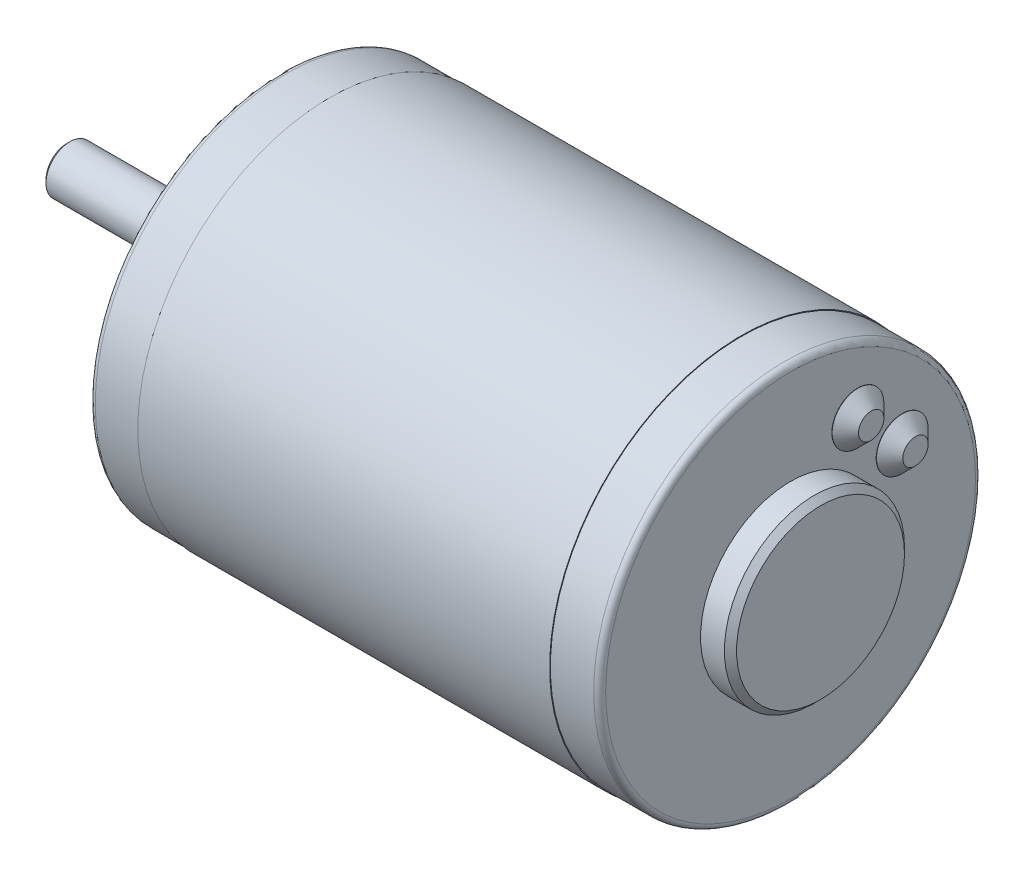
ISO-10303-21;
HEADER;
FILE_DESCRIPTION(('STEP AP214'),'2;1');
FILE_NAME('part.step','',(''),(''),'','','');
FILE_SCHEMA(('AUTOMOTIVE_DESIGN { 1 0 10303 214 1 1 1 1 }'));
ENDSEC;
DATA;
#1=APPLICATION_CONTEXT('core data for automotive mechanical design processes');
#2=APPLICATION_PROTOCOL_DEFINITION('international standard','automotive_design',2000,#1);
#3=PRODUCT_CONTEXT('',#1,'mechanical');
#4=PRODUCT('Part','Part','',(#3));
#5=PRODUCT_RELATED_PRODUCT_CATEGORY('part','',(#4));
#6=PRODUCT_DEFINITION_FORMATION('','',#4);
#7=PRODUCT_DEFINITION_CONTEXT('part definition',#1,'design');
#8=PRODUCT_DEFINITION('design','',#6,#7);
#9=PRODUCT_DEFINITION_SHAPE('','',#8);
#10=(LENGTH_UNIT() NAMED_UNIT(*) SI_UNIT(.MILLI.,.METRE.));
#11=(NAMED_UNIT(*) PLANE_ANGLE_UNIT() SI_UNIT($,.RADIAN.));
#12=(NAMED_UNIT(*) SI_UNIT($,.STERADIAN.) SOLID_ANGLE_UNIT());
#13=UNCERTAINTY_MEASURE_WITH_UNIT(LENGTH_MEASURE(1.E-05),#10,'distance_accuracy_value','');
#14=(GEOMETRIC_REPRESENTATION_CONTEXT(3) GLOBAL_UNCERTAINTY_ASSIGNED_CONTEXT((#13)) GLOBAL_UNIT_ASSIGNED_CONTEXT((#10,
#11,#12)) REPRESENTATION_CONTEXT('',''));
#15=CARTESIAN_POINT('',(0.,0.,0.));
#16=DIRECTION('',(0.,0.,1.));
#17=DIRECTION('',(1.,0.,0.));
#18=AXIS2_PLACEMENT_3D('',#15,#16,#17);
#19=CARTESIAN_POINT('',(8.2296,0.,0.));
#20=DIRECTION('',(1.,0.,0.));
#21=DIRECTION('',(0.,0.,-1.));
#22=AXIS2_PLACEMENT_3D('',#19,#20,#21);
#23=CYLINDRICAL_SURFACE('',#22,32.004);
#24=CARTESIAN_POINT('',(8.2296,0.,0.));
#25=DIRECTION('',(1.,0.,0.));
#26=DIRECTION('',(0.,0.,-1.));
#27=AXIS2_PLACEMENT_3D('',#24,#25,#26);
#28=CIRCLE('',#27,32.004);
#29=CARTESIAN_POINT('',(8.2296,0.,-32.004));
#30=VERTEX_POINT('',#29);
#31=EDGE_CURVE('E96',#30,#30,#28,.T.);
#32=ORIENTED_EDGE('',*,*,#31,.T.);
#33=EDGE_LOOP('',(#32));
#34=FACE_BOUND('',#33,.T.);
#35=CARTESIAN_POINT('',(76.9864,0.,0.));
#36=DIRECTION('',(1.,0.,0.));
#37=DIRECTION('',(0.,0.,-1.));
#38=AXIS2_PLACEMENT_3D('',#35,#36,#37);
#39=CIRCLE('',#38,32.004);
#40=CARTESIAN_POINT('',(76.9864,0.,-32.004));
#41=VERTEX_POINT('',#40);
#42=EDGE_CURVE('E79',#41,#41,#39,.T.);
#43=ORIENTED_EDGE('',*,*,#42,.F.);
#44=EDGE_LOOP('',(#43));
#45=FACE_BOUND('',#44,.T.);
#46=ADVANCED_FACE('F32',(#34,#45),#23,.T.);
#47=CARTESIAN_POINT('',(8.2296,32.004,0.));
#48=DIRECTION('',(-1.,0.,0.));
#49=DIRECTION('',(0.,0.,1.));
#50=AXIS2_PLACEMENT_3D('',#47,#48,#49);
#51=PLANE('',#50);
#52=CARTESIAN_POINT('',(8.2296,0.,0.));
#53=DIRECTION('',(-1.,0.,0.));
#54=DIRECTION('',(0.,0.,1.));
#55=AXIS2_PLACEMENT_3D('',#52,#53,#54);
#56=CIRCLE('',#55,31.877);
#57=CARTESIAN_POINT('',(8.2296,0.,31.877));
#58=VERTEX_POINT('',#57);
#59=EDGE_CURVE('E87',#58,#58,#56,.T.);
#60=ORIENTED_EDGE('',*,*,#59,.F.);
#61=EDGE_LOOP('',(#60));
#62=FACE_BOUND('',#61,.T.);
#63=ORIENTED_EDGE('',*,*,#31,.F.);
#64=EDGE_LOOP('',(#63));
#65=FACE_BOUND('',#64,.T.);
#66=ADVANCED_FACE('F145',(#62,#65),#51,.T.);
#67=CARTESIAN_POINT('',(76.9864,0.,0.));
#68=DIRECTION('',(1.,0.,0.));
#69=DIRECTION('',(0.,0.,-1.));
#70=AXIS2_PLACEMENT_3D('',#67,#68,#69);
#71=PLANE('',#70);
#72=CARTESIAN_POINT('',(76.9864,0.,0.));
#73=DIRECTION('',(1.,0.,0.));
#74=DIRECTION('',(0.,0.,-1.));
#75=AXIS2_PLACEMENT_3D('',#72,#73,#74);
#76=CIRCLE('',#75,31.877);
#77=CARTESIAN_POINT('',(76.9864,0.,-31.877));
#78=VERTEX_POINT('',#77);
#79=EDGE_CURVE('E93',#78,#78,#76,.T.);
#80=ORIENTED_EDGE('',*,*,#79,.F.);
#81=EDGE_LOOP('',(#80));
#82=FACE_BOUND('',#81,.T.);
#83=ORIENTED_EDGE('',*,*,#42,.T.);
#84=EDGE_LOOP('',(#83));
#85=FACE_BOUND('',#84,.T.);
#86=ADVANCED_FACE('F151',(#82,#85),#71,.T.);
#87=CARTESIAN_POINT('',(85.216,0.,0.));
#88=DIRECTION('',(-1.,0.,0.));
#89=DIRECTION('',(0.,0.,1.));
#90=AXIS2_PLACEMENT_3D('',#87,#88,#89);
#91=CYLINDRICAL_SURFACE('',#90,31.877);
#92=CARTESIAN_POINT('',(84.216,0.,0.));
#93=DIRECTION('',(1.,0.,0.));
#94=DIRECTION('',(0.,0.,-1.));
#95=AXIS2_PLACEMENT_3D('',#92,#93,#94);
#96=CIRCLE('',#95,31.877);
#97=CARTESIAN_POINT('',(84.216,0.,-31.877));
#98=VERTEX_POINT('',#97);
#99=EDGE_CURVE('E11',#98,#98,#96,.F.);
#100=ORIENTED_EDGE('',*,*,#99,.T.);
#101=EDGE_LOOP('',(#100));
#102=FACE_BOUND('',#101,.T.);
#103=ORIENTED_EDGE('',*,*,#79,.T.);
#104=EDGE_LOOP('',(#103));
#105=FACE_BOUND('',#104,.T.);
#106=ADVANCED_FACE('F215',(#102,#105),#91,.T.);
#107=CARTESIAN_POINT('',(85.216,0.,0.));
#108=DIRECTION('',(1.,0.,0.));
#109=DIRECTION('',(0.,0.,-1.));
#110=AXIS2_PLACEMENT_3D('',#107,#108,#109);
#111=PLANE('',#110);
#112=CARTESIAN_POINT('',(85.216,0.,0.));
#113=DIRECTION('',(1.,0.,0.));
#114=DIRECTION('',(0.,0.,-1.));
#115=AXIS2_PLACEMENT_3D('',#112,#113,#114);
#116=CIRCLE('',#115,30.877);
#117=CARTESIAN_POINT('',(85.216,0.,-30.877));
#118=VERTEX_POINT('',#117);
#119=EDGE_CURVE('E40',#118,#118,#116,.T.);
#120=ORIENTED_EDGE('',*,*,#119,.T.);
#121=EDGE_LOOP('',(#120));
#122=FACE_BOUND('',#121,.T.);
#123=CARTESIAN_POINT('',(85.216,18.6070906828553,-11.2073596390943));
#124=DIRECTION('',(1.,0.,0.));
#125=DIRECTION('',(0.,0.,-1.));
#126=AXIS2_PLACEMENT_3D('',#123,#124,#125);
#127=CIRCLE('',#126,4.318);
#128=CARTESIAN_POINT('',(85.216,18.6070906828553,-15.5253596390943));
#129=VERTEX_POINT('',#128);
#130=EDGE_CURVE('E103',#129,#129,#127,.T.);
#131=ORIENTED_EDGE('',*,*,#130,.F.);
#132=EDGE_LOOP('',(#131));
#133=FACE_BOUND('',#132,.T.);
#134=CARTESIAN_POINT('',(85.216,11.2073596390943,-18.6070906828553));
#135=DIRECTION('',(1.,0.,0.));
#136=DIRECTION('',(0.,0.,-1.));
#137=AXIS2_PLACEMENT_3D('',#134,#135,#136);
#138=CIRCLE('',#137,4.318);
#139=CARTESIAN_POINT('',(85.216,11.2073596390943,-22.9250906828553));
#140=VERTEX_POINT('',#139);
#141=EDGE_CURVE('E83',#140,#140,#138,.T.);
#142=ORIENTED_EDGE('',*,*,#141,.F.);
#143=EDGE_LOOP('',(#142));
#144=FACE_BOUND('',#143,.T.);
#145=CARTESIAN_POINT('',(85.216,0.,0.));
#146=DIRECTION('',(1.,0.,0.));
#147=DIRECTION('',(0.,0.,-1.));
#148=AXIS2_PLACEMENT_3D('',#145,#146,#147);
#149=CIRCLE('',#148,15.0368);
#150=CARTESIAN_POINT('',(85.216,0.,-15.0368));
#151=VERTEX_POINT('',#150);
#152=EDGE_CURVE('E90',#151,#151,#149,.T.);
#153=ORIENTED_EDGE('',*,*,#152,.F.);
#154=EDGE_LOOP('',(#153));
#155=FACE_BOUND('',#154,.T.);
#156=ADVANCED_FACE('F132',(#122,#133,#144,#155),#111,.T.);
#157=CARTESIAN_POINT('',(90.216,0.,0.));
#158=DIRECTION('',(-1.,0.,0.));
#159=DIRECTION('',(0.,0.,1.));
#160=AXIS2_PLACEMENT_3D('',#157,#158,#159);
#161=CYLINDRICAL_SURFACE('',#160,15.0368);
#162=CARTESIAN_POINT('',(89.2,0.,0.));
#163=DIRECTION('',(1.,0.,0.));
#164=DIRECTION('',(0.,0.,-1.));
#165=AXIS2_PLACEMENT_3D('',#162,#163,#164);
#166=CIRCLE('',#165,15.0368);
#167=CARTESIAN_POINT('',(89.2,0.,-15.0368));
#168=VERTEX_POINT('',#167);
#169=EDGE_CURVE('E115',#168,#168,#166,.F.);
#170=ORIENTED_EDGE('',*,*,#169,.T.);
#171=EDGE_LOOP('',(#170));
#172=FACE_BOUND('',#171,.T.);
#173=ORIENTED_EDGE('',*,*,#152,.T.);
#174=EDGE_LOOP('',(#173));
#175=FACE_BOUND('',#174,.T.);
#176=ADVANCED_FACE('F208',(#172,#175),#161,.T.);
#177=CARTESIAN_POINT('',(90.216,0.,0.));
#178=DIRECTION('',(1.,0.,0.));
#179=DIRECTION('',(0.,0.,-1.));
#180=AXIS2_PLACEMENT_3D('',#177,#178,#179);
#181=PLANE('',#180);
#182=CARTESIAN_POINT('',(90.216,0.,0.));
#183=DIRECTION('',(1.,0.,0.));
#184=DIRECTION('',(0.,0.,-1.));
#185=AXIS2_PLACEMENT_3D('',#182,#183,#184);
#186=CIRCLE('',#185,14.0208);
#187=CARTESIAN_POINT('',(90.216,0.,-14.0208));
#188=VERTEX_POINT('',#187);
#189=EDGE_CURVE('E112',#188,#188,#186,.T.);
#190=ORIENTED_EDGE('',*,*,#189,.T.);
#191=EDGE_LOOP('',(#190));
#192=FACE_BOUND('',#191,.T.);
#193=ADVANCED_FACE('F204',(#192),#181,.T.);
#194=CARTESIAN_POINT('',(0.,0.,0.));
#195=DIRECTION('',(1.,0.,0.));
#196=DIRECTION('',(0.,0.,-1.));
#197=AXIS2_PLACEMENT_3D('',#194,#195,#196);
#198=CYLINDRICAL_SURFACE('',#197,31.877);
#199=CARTESIAN_POINT('',(0.999999999999997,0.,0.));
#200=DIRECTION('',(-1.,0.,0.));
#201=DIRECTION('',(0.,0.,1.));
#202=AXIS2_PLACEMENT_3D('',#199,#200,#201);
#203=CIRCLE('',#202,31.877);
#204=CARTESIAN_POINT('',(0.999999999999997,0.,31.877));
#205=VERTEX_POINT('',#204);
#206=EDGE_CURVE('E127',#205,#205,#203,.F.);
#207=ORIENTED_EDGE('',*,*,#206,.T.);
#208=EDGE_LOOP('',(#207));
#209=FACE_BOUND('',#208,.T.);
#210=ORIENTED_EDGE('',*,*,#59,.T.);
#211=EDGE_LOOP('',(#210));
#212=FACE_BOUND('',#211,.T.);
#213=ADVANCED_FACE('F200',(#209,#212),#198,.T.);
#214=CARTESIAN_POINT('',(0.,0.,0.));
#215=DIRECTION('',(-1.,0.,0.));
#216=DIRECTION('',(0.,0.,1.));
#217=AXIS2_PLACEMENT_3D('',#214,#215,#216);
#218=PLANE('',#217);
#219=CARTESIAN_POINT('',(0.,0.,0.));
#220=DIRECTION('',(-1.,0.,0.));
#221=DIRECTION('',(0.,0.,1.));
#222=AXIS2_PLACEMENT_3D('',#219,#220,#221);
#223=CIRCLE('',#222,30.877);
#224=CARTESIAN_POINT('',(0.,0.,30.877));
#225=VERTEX_POINT('',#224);
#226=EDGE_CURVE('E124',#225,#225,#223,.T.);
#227=ORIENTED_EDGE('',*,*,#226,.T.);
#228=EDGE_LOOP('',(#227));
#229=FACE_BOUND('',#228,.T.);
#230=CARTESIAN_POINT('',(0.,25.4,0.));
#231=DIRECTION('',(-1.,0.,0.));
#232=DIRECTION('',(0.,0.,1.));
#233=AXIS2_PLACEMENT_3D('',#230,#231,#232);
#234=CIRCLE('',#233,2.01929999999999);
#235=CARTESIAN_POINT('',(0.,25.4,2.01929999999999));
#236=VERTEX_POINT('',#235);
#237=EDGE_CURVE('E57',#236,#236,#234,.T.);
#238=ORIENTED_EDGE('',*,*,#237,.F.);
#239=EDGE_LOOP('',(#238));
#240=FACE_BOUND('',#239,.T.);
#241=CARTESIAN_POINT('',(0.,-25.4,0.));
#242=DIRECTION('',(-1.,0.,0.));
#243=DIRECTION('',(0.,0.,1.));
#244=AXIS2_PLACEMENT_3D('',#241,#242,#243);
#245=CIRCLE('',#244,2.01929999999999);
#246=CARTESIAN_POINT('',(0.,-25.4,2.01929999999999));
#247=VERTEX_POINT('',#246);
#248=EDGE_CURVE('E56',#247,#247,#245,.T.);
#249=ORIENTED_EDGE('',*,*,#248,.F.);
#250=EDGE_LOOP('',(#249));
#251=FACE_BOUND('',#250,.T.);
#252=CARTESIAN_POINT('',(0.,0.,0.));
#253=DIRECTION('',(-1.,0.,0.));
#254=DIRECTION('',(0.,0.,1.));
#255=AXIS2_PLACEMENT_3D('',#252,#253,#254);
#256=CIRCLE('',#255,9.525);
#257=CARTESIAN_POINT('',(0.,0.,9.525));
#258=VERTEX_POINT('',#257);
#259=EDGE_CURVE('E84',#258,#258,#256,.T.);
#260=ORIENTED_EDGE('',*,*,#259,.F.);
#261=EDGE_LOOP('',(#260));
#262=FACE_BOUND('',#261,.T.);
#263=ADVANCED_FACE('F196',(#229,#240,#251,#262),#218,.T.);
#264=CARTESIAN_POINT('',(-4.,0.,0.));
#265=DIRECTION('',(1.,0.,0.));
#266=DIRECTION('',(0.,0.,-1.));
#267=AXIS2_PLACEMENT_3D('',#264,#265,#266);
#268=CYLINDRICAL_SURFACE('',#267,9.525);
#269=CARTESIAN_POINT('',(-2.98400000000003,0.,0.));
#270=DIRECTION('',(-1.,0.,0.));
#271=DIRECTION('',(0.,0.,1.));
#272=AXIS2_PLACEMENT_3D('',#269,#270,#271);
#273=CIRCLE('',#272,9.525);
#274=CARTESIAN_POINT('',(-2.98400000000003,0.,9.525));
#275=VERTEX_POINT('',#274);
#276=EDGE_CURVE('E109',#275,#275,#273,.F.);
#277=ORIENTED_EDGE('',*,*,#276,.T.);
#278=EDGE_LOOP('',(#277));
#279=FACE_BOUND('',#278,.T.);
#280=ORIENTED_EDGE('',*,*,#259,.T.);
#281=EDGE_LOOP('',(#280));
#282=FACE_BOUND('',#281,.T.);
#283=ADVANCED_FACE('F192',(#279,#282),#268,.T.);
#284=CARTESIAN_POINT('',(-4.,0.,0.));
#285=DIRECTION('',(-1.,0.,0.));
#286=DIRECTION('',(0.,0.,1.));
#287=AXIS2_PLACEMENT_3D('',#284,#285,#286);
#288=PLANE('',#287);
#289=CARTESIAN_POINT('',(-4.,0.,0.));
#290=DIRECTION('',(-1.,0.,0.));
#291=DIRECTION('',(0.,0.,1.));
#292=AXIS2_PLACEMENT_3D('',#289,#290,#291);
#293=CIRCLE('',#292,8.50900000000003);
#294=CARTESIAN_POINT('',(-4.,0.,8.50900000000003));
#295=VERTEX_POINT('',#294);
#296=EDGE_CURVE('E106',#295,#295,#293,.T.);
#297=ORIENTED_EDGE('',*,*,#296,.T.);
#298=EDGE_LOOP('',(#297));
#299=FACE_BOUND('',#298,.T.);
#300=CARTESIAN_POINT('',(-4.,0.,0.));
#301=DIRECTION('',(-1.,0.,0.));
#302=DIRECTION('',(0.,0.,1.));
#303=AXIS2_PLACEMENT_3D('',#300,#301,#302);
#304=CIRCLE('',#303,4.);
#305=CARTESIAN_POINT('',(-4.,0.,4.));
#306=VERTEX_POINT('',#305);
#307=EDGE_CURVE('E80',#306,#306,#304,.T.);
#308=ORIENTED_EDGE('',*,*,#307,.F.);
#309=EDGE_LOOP('',(#308));
#310=FACE_BOUND('',#309,.T.);
#311=ADVANCED_FACE('F185',(#299,#310),#288,.T.);
#312=CARTESIAN_POINT('',(-35.6,0.,0.));
#313=DIRECTION('',(1.,0.,0.));
#314=DIRECTION('',(0.,0.,-1.));
#315=AXIS2_PLACEMENT_3D('',#312,#313,#314);
#316=CYLINDRICAL_SURFACE('',#315,4.);
#317=CARTESIAN_POINT('',(-35.0999999999929,0.,0.));
#318=DIRECTION('',(-1.,0.,0.));
#319=DIRECTION('',(0.,0.,1.));
#320=AXIS2_PLACEMENT_3D('',#317,#318,#319);
#321=CIRCLE('',#320,4.);
#322=CARTESIAN_POINT('',(-35.0999999999929,0.,4.));
#323=VERTEX_POINT('',#322);
#324=EDGE_CURVE('E121',#323,#323,#321,.F.);
#325=ORIENTED_EDGE('',*,*,#324,.T.);
#326=EDGE_LOOP('',(#325));
#327=FACE_BOUND('',#326,.T.);
#328=ORIENTED_EDGE('',*,*,#307,.T.);
#329=EDGE_LOOP('',(#328));
#330=FACE_BOUND('',#329,.T.);
#331=ADVANCED_FACE('F176',(#327,#330),#316,.T.);
#332=CARTESIAN_POINT('',(-35.6,0.,0.));
#333=DIRECTION('',(-1.,0.,0.));
#334=DIRECTION('',(0.,0.,1.));
#335=AXIS2_PLACEMENT_3D('',#332,#333,#334);
#336=PLANE('',#335);
#337=CARTESIAN_POINT('',(-35.6,0.,0.));
#338=DIRECTION('',(-1.,0.,0.));
#339=DIRECTION('',(0.,0.,1.));
#340=AXIS2_PLACEMENT_3D('',#337,#338,#339);
#341=CIRCLE('',#340,3.4999999999361);
#342=CARTESIAN_POINT('',(-35.6,0.,3.4999999999361));
#343=VERTEX_POINT('',#342);
#344=EDGE_CURVE('E118',#343,#343,#341,.T.);
#345=ORIENTED_EDGE('',*,*,#344,.T.);
#346=EDGE_LOOP('',(#345));
#347=FACE_BOUND('',#346,.T.);
#348=ADVANCED_FACE('F173',(#347),#336,.T.);
#349=CARTESIAN_POINT('',(85.216,11.2073596390943,-18.6070906828553));
#350=DIRECTION('',(1.,0.,0.));
#351=DIRECTION('',(0.,0.,-1.));
#352=AXIS2_PLACEMENT_3D('',#349,#350,#351);
#353=CYLINDRICAL_SURFACE('',#352,4.318);
#354=ORIENTED_EDGE('',*,*,#141,.T.);
#355=EDGE_LOOP('',(#354));
#356=FACE_BOUND('',#355,.T.);
#357=CARTESIAN_POINT('',(85.2639,11.2073596390943,-18.6070906828553));
#358=DIRECTION('',(1.,0.,0.));
#359=DIRECTION('',(0.,0.,-1.));
#360=AXIS2_PLACEMENT_3D('',#357,#358,#359);
#361=CIRCLE('',#360,4.318);
#362=CARTESIAN_POINT('',(85.2639,11.2073596390943,-22.9250906828553));
#363=VERTEX_POINT('',#362);
#364=EDGE_CURVE('E73',#363,#363,#361,.T.);
#365=ORIENTED_EDGE('',*,*,#364,.F.);
#366=EDGE_LOOP('',(#365));
#367=FACE_BOUND('',#366,.T.);
#368=ADVANCED_FACE('F175',(#356,#367),#353,.T.);
#369=CARTESIAN_POINT('',(87.4638999999649,11.2073596390943,-18.6070906828553));
#370=DIRECTION('',(1.,0.,0.));
#371=DIRECTION('',(0.,0.,-1.));
#372=AXIS2_PLACEMENT_3D('',#369,#370,#371);
#373=PLANE('',#372);
#374=CARTESIAN_POINT('',(87.4638999999649,11.2073596390943,-18.6070906828553));
#375=DIRECTION('',(1.,0.,0.));
#376=DIRECTION('',(0.,0.,-1.));
#377=AXIS2_PLACEMENT_3D('',#374,#375,#376);
#378=CIRCLE('',#377,2.11800000003506);
#379=CARTESIAN_POINT('',(87.4638999999649,11.2073596390943,-20.7250906828904));
#380=VERTEX_POINT('',#379);
#381=EDGE_CURVE('E76',#380,#380,#378,.T.);
#382=ORIENTED_EDGE('',*,*,#381,.T.);
#383=EDGE_LOOP('',(#382));
#384=FACE_BOUND('',#383,.T.);
#385=ADVANCED_FACE('F182',(#384),#373,.T.);
#386=CARTESIAN_POINT('',(87.4638999999649,11.2073596390943,-18.6070906828553));
#387=DIRECTION('',(-1.,0.,0.));
#388=DIRECTION('',(0.,0.,1.));
#389=AXIS2_PLACEMENT_3D('',#386,#387,#388);
#390=CONICAL_SURFACE('',#389,2.11800000003506,0.78539816339745);
#391=ORIENTED_EDGE('',*,*,#364,.T.);
#392=EDGE_LOOP('',(#391));
#393=FACE_BOUND('',#392,.T.);
#394=ORIENTED_EDGE('',*,*,#381,.F.);
#395=EDGE_LOOP('',(#394));
#396=FACE_BOUND('',#395,.T.);
#397=ADVANCED_FACE('F350',(#393,#396),#390,.T.);
#398=CARTESIAN_POINT('',(85.216,18.6070906828553,-11.2073596390943));
#399=DIRECTION('',(1.,0.,0.));
#400=DIRECTION('',(0.,0.,-1.));
#401=AXIS2_PLACEMENT_3D('',#398,#399,#400);
#402=CYLINDRICAL_SURFACE('',#401,4.318);
#403=ORIENTED_EDGE('',*,*,#130,.T.);
#404=EDGE_LOOP('',(#403));
#405=FACE_BOUND('',#404,.T.);
#406=CARTESIAN_POINT('',(85.2639,18.6070906828553,-11.2073596390943));
#407=DIRECTION('',(1.,0.,0.));
#408=DIRECTION('',(0.,0.,-1.));
#409=AXIS2_PLACEMENT_3D('',#406,#407,#408);
#410=CIRCLE('',#409,4.318);
#411=CARTESIAN_POINT('',(85.2639,18.6070906828553,-15.5253596390943));
#412=VERTEX_POINT('',#411);
#413=EDGE_CURVE('E67',#412,#412,#410,.T.);
#414=ORIENTED_EDGE('',*,*,#413,.F.);
#415=EDGE_LOOP('',(#414));
#416=FACE_BOUND('',#415,.T.);
#417=ADVANCED_FACE('F341',(#405,#416),#402,.T.);
#418=CARTESIAN_POINT('',(87.4638999999503,18.6070906828553,-11.2073596390943));
#419=DIRECTION('',(1.,0.,0.));
#420=DIRECTION('',(0.,0.,-1.));
#421=AXIS2_PLACEMENT_3D('',#418,#419,#420);
#422=PLANE('',#421);
#423=CARTESIAN_POINT('',(87.4638999999503,18.6070906828553,-11.2073596390943));
#424=DIRECTION('',(1.,0.,0.));
#425=DIRECTION('',(0.,0.,-1.));
#426=AXIS2_PLACEMENT_3D('',#423,#424,#425);
#427=CIRCLE('',#426,2.11800000004973);
#428=CARTESIAN_POINT('',(87.4638999999503,18.6070906828553,-13.3253596391441));
#429=VERTEX_POINT('',#428);
#430=EDGE_CURVE('E70',#429,#429,#427,.T.);
#431=ORIENTED_EDGE('',*,*,#430,.T.);
#432=EDGE_LOOP('',(#431));
#433=FACE_BOUND('',#432,.T.);
#434=ADVANCED_FACE('F332',(#433),#422,.T.);
#435=CARTESIAN_POINT('',(87.4638999999503,18.6070906828553,-11.2073596390943));
#436=DIRECTION('',(-1.,0.,0.));
#437=DIRECTION('',(0.,0.,1.));
#438=AXIS2_PLACEMENT_3D('',#435,#436,#437);
#439=CONICAL_SURFACE('',#438,2.11800000004973,0.785398163397448);
#440=ORIENTED_EDGE('',*,*,#413,.T.);
#441=EDGE_LOOP('',(#440));
#442=FACE_BOUND('',#441,.T.);
#443=ORIENTED_EDGE('',*,*,#430,.F.);
#444=EDGE_LOOP('',(#443));
#445=FACE_BOUND('',#444,.T.);
#446=ADVANCED_FACE('F324',(#442,#445),#439,.T.);
#447=CARTESIAN_POINT('',(13.6144,-25.4,0.));
#448=DIRECTION('',(-1.,0.,0.));
#449=DIRECTION('',(0.,0.,1.));
#450=AXIS2_PLACEMENT_3D('',#447,#448,#449);
#451=CONICAL_SURFACE('',#450,2.01929999999999,1.02974425867198);
#452=CARTESIAN_POINT('',(14.8277178480152,-25.4,0.));
#453=VERTEX_POINT('',#452);
#454=VERTEX_LOOP('',#453);
#455=FACE_BOUND('',#454,.T.);
#456=CARTESIAN_POINT('',(13.6144,-25.4,0.));
#457=DIRECTION('',(-1.,0.,0.));
#458=DIRECTION('',(0.,0.,1.));
#459=AXIS2_PLACEMENT_3D('',#456,#457,#458);
#460=CIRCLE('',#459,2.01929999999999);
#461=CARTESIAN_POINT('',(13.6144,-25.4,2.01929999999999));
#462=VERTEX_POINT('',#461);
#463=EDGE_CURVE('E60',#462,#462,#460,.T.);
#464=ORIENTED_EDGE('',*,*,#463,.T.);
#465=EDGE_LOOP('',(#464));
#466=FACE_BOUND('',#465,.T.);
#467=ADVANCED_FACE('F315',(#455,#466),#451,.F.);
#468=CARTESIAN_POINT('',(0.,-25.4,0.));
#469=DIRECTION('',(-1.,0.,0.));
#470=DIRECTION('',(0.,0.,1.));
#471=AXIS2_PLACEMENT_3D('',#468,#469,#470);
#472=CYLINDRICAL_SURFACE('',#471,2.01929999999999);
#473=ORIENTED_EDGE('',*,*,#463,.F.);
#474=EDGE_LOOP('',(#473));
#475=FACE_BOUND('',#474,.T.);
#476=ORIENTED_EDGE('',*,*,#248,.T.);
#477=EDGE_LOOP('',(#476));
#478=FACE_BOUND('',#477,.T.);
#479=ADVANCED_FACE('F50',(#475,#478),#472,.F.);
#480=CARTESIAN_POINT('',(13.6144,25.4,0.));
#481=DIRECTION('',(-1.,0.,0.));
#482=DIRECTION('',(0.,0.,1.));
#483=AXIS2_PLACEMENT_3D('',#480,#481,#482);
#484=CONICAL_SURFACE('',#483,2.01929999999999,1.02974425867198);
#485=CARTESIAN_POINT('',(14.8277178480152,25.4,0.));
#486=VERTEX_POINT('',#485);
#487=VERTEX_LOOP('',#486);
#488=FACE_BOUND('',#487,.T.);
#489=CARTESIAN_POINT('',(13.6144,25.4,0.));
#490=DIRECTION('',(-1.,0.,0.));
#491=DIRECTION('',(0.,0.,1.));
#492=AXIS2_PLACEMENT_3D('',#489,#490,#491);
#493=CIRCLE('',#492,2.01929999999999);
#494=CARTESIAN_POINT('',(13.6144,25.4,2.01929999999999));
#495=VERTEX_POINT('',#494);
#496=EDGE_CURVE('E54',#495,#495,#493,.T.);
#497=ORIENTED_EDGE('',*,*,#496,.T.);
#498=EDGE_LOOP('',(#497));
#499=FACE_BOUND('',#498,.T.);
#500=ADVANCED_FACE('F46',(#488,#499),#484,.F.);
#501=CARTESIAN_POINT('',(0.,25.4,0.));
#502=DIRECTION('',(-1.,0.,0.));
#503=DIRECTION('',(0.,0.,1.));
#504=AXIS2_PLACEMENT_3D('',#501,#502,#503);
#505=CYLINDRICAL_SURFACE('',#504,2.01929999999999);
#506=ORIENTED_EDGE('',*,*,#496,.F.);
#507=EDGE_LOOP('',(#506));
#508=FACE_BOUND('',#507,.T.);
#509=ORIENTED_EDGE('',*,*,#237,.T.);
#510=EDGE_LOOP('',(#509));
#511=FACE_BOUND('',#510,.T.);
#512=ADVANCED_FACE('F49',(#508,#511),#505,.F.);
#513=CARTESIAN_POINT('',(-4.,0.,0.));
#514=DIRECTION('',(1.,0.,0.));
#515=DIRECTION('',(0.,0.,-1.));
#516=AXIS2_PLACEMENT_3D('',#513,#514,#515);
#517=CONICAL_SURFACE('',#516,8.50900000000003,0.785398163397447);
#518=ORIENTED_EDGE('',*,*,#276,.F.);
#519=EDGE_LOOP('',(#518));
#520=FACE_BOUND('',#519,.T.);
#521=ORIENTED_EDGE('',*,*,#296,.F.);
#522=EDGE_LOOP('',(#521));
#523=FACE_BOUND('',#522,.T.);
#524=ADVANCED_FACE('F157',(#520,#523),#517,.T.);
#525=CARTESIAN_POINT('',(90.216,0.,0.));
#526=DIRECTION('',(-1.,0.,0.));
#527=DIRECTION('',(0.,0.,1.));
#528=AXIS2_PLACEMENT_3D('',#525,#526,#527);
#529=CONICAL_SURFACE('',#528,14.0208,0.785398163397447);
#530=ORIENTED_EDGE('',*,*,#169,.F.);
#531=EDGE_LOOP('',(#530));
#532=FACE_BOUND('',#531,.T.);
#533=ORIENTED_EDGE('',*,*,#189,.F.);
#534=EDGE_LOOP('',(#533));
#535=FACE_BOUND('',#534,.T.);
#536=ADVANCED_FACE('F160',(#532,#535),#529,.T.);
#537=CARTESIAN_POINT('',(-35.6,0.,0.));
#538=DIRECTION('',(1.,0.,0.));
#539=DIRECTION('',(0.,0.,-1.));
#540=AXIS2_PLACEMENT_3D('',#537,#538,#539);
#541=CONICAL_SURFACE('',#540,3.4999999999361,0.785398163454291);
#542=ORIENTED_EDGE('',*,*,#324,.F.);
#543=EDGE_LOOP('',(#542));
#544=FACE_BOUND('',#543,.T.);
#545=ORIENTED_EDGE('',*,*,#344,.F.);
#546=EDGE_LOOP('',(#545));
#547=FACE_BOUND('',#546,.T.);
#548=ADVANCED_FACE('F141',(#544,#547),#541,.T.);
#549=CARTESIAN_POINT('',(0.999999999999997,0.,0.));
#550=DIRECTION('',(-1.,0.,0.));
#551=DIRECTION('',(0.,0.,1.));
#552=AXIS2_PLACEMENT_3D('',#549,#550,#551);
#553=TOROIDAL_SURFACE('',#552,30.877,0.999999999999999);
#554=ORIENTED_EDGE('',*,*,#206,.F.);
#555=EDGE_LOOP('',(#554));
#556=FACE_BOUND('',#555,.T.);
#557=ORIENTED_EDGE('',*,*,#226,.F.);
#558=EDGE_LOOP('',(#557));
#559=FACE_BOUND('',#558,.T.);
#560=ADVANCED_FACE('F136',(#556,#559),#553,.T.);
#561=CARTESIAN_POINT('',(84.216,0.,0.));
#562=DIRECTION('',(1.,0.,0.));
#563=DIRECTION('',(0.,0.,-1.));
#564=AXIS2_PLACEMENT_3D('',#561,#562,#563);
#565=TOROIDAL_SURFACE('',#564,30.877,0.999999999999999);
#566=ORIENTED_EDGE('',*,*,#99,.F.);
#567=EDGE_LOOP('',(#566));
#568=FACE_BOUND('',#567,.T.);
#569=ORIENTED_EDGE('',*,*,#119,.F.);
#570=EDGE_LOOP('',(#569));
#571=FACE_BOUND('',#570,.T.);
#572=ADVANCED_FACE('F34',(#568,#571),#565,.T.);
#573=CLOSED_SHELL('',(#46,#66,#86,#106,#156,#176,#193,#213,#263,#283,#311,#331,#348,#368,#385,
#397,#417,#434,#446,#467,#479,#500,#512,#524,#536,#548,#560,#572));
#574=MANIFOLD_SOLID_BREP('B2',#573);
#575=ADVANCED_BREP_SHAPE_REPRESENTATION('',(#18,#574),#14);
#576=SHAPE_DEFINITION_REPRESENTATION(#9,#575);
ENDSEC;
END-ISO-10303-21;
